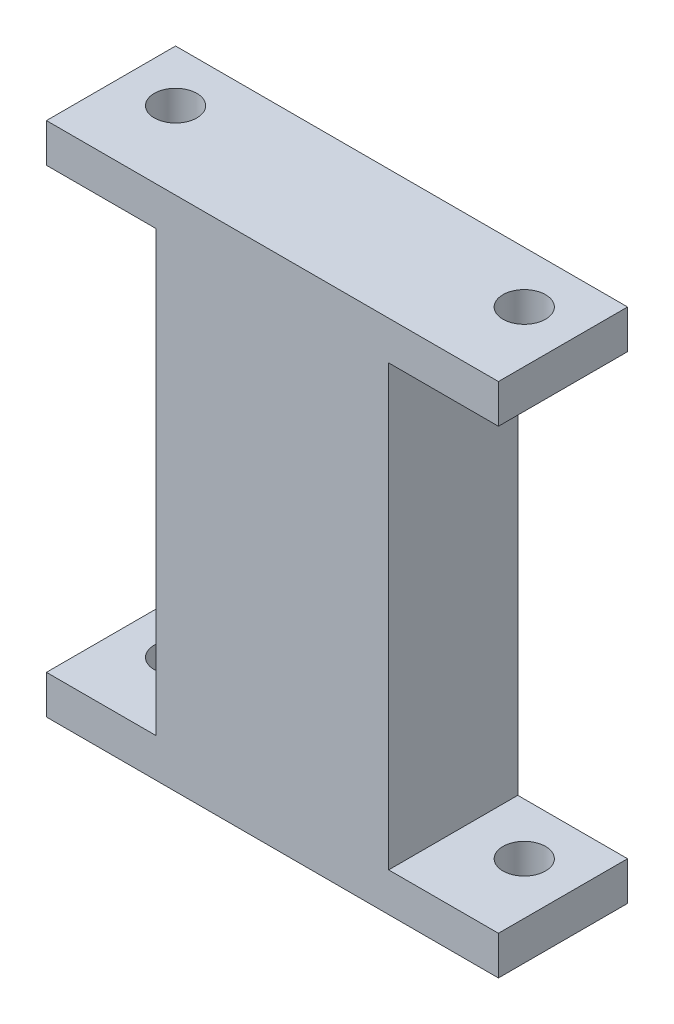
ISO-10303-21;
HEADER;
FILE_DESCRIPTION(('STEP AP214'),'2;1');
FILE_NAME('part.step','',(''),(''),'','','');
FILE_SCHEMA(('AUTOMOTIVE_DESIGN { 1 0 10303 214 1 1 1 1 }'));
ENDSEC;
DATA;
#1=APPLICATION_CONTEXT('core data for automotive mechanical design processes');
#2=APPLICATION_PROTOCOL_DEFINITION('international standard','automotive_design',2000,#1);
#3=PRODUCT_CONTEXT('',#1,'mechanical');
#4=PRODUCT('Part','Part','',(#3));
#5=PRODUCT_RELATED_PRODUCT_CATEGORY('part','',(#4));
#6=PRODUCT_DEFINITION_FORMATION('','',#4);
#7=PRODUCT_DEFINITION_CONTEXT('part definition',#1,'design');
#8=PRODUCT_DEFINITION('design','',#6,#7);
#9=PRODUCT_DEFINITION_SHAPE('','',#8);
#10=(LENGTH_UNIT() NAMED_UNIT(*) SI_UNIT(.MILLI.,.METRE.));
#11=(NAMED_UNIT(*) PLANE_ANGLE_UNIT() SI_UNIT($,.RADIAN.));
#12=(NAMED_UNIT(*) SI_UNIT($,.STERADIAN.) SOLID_ANGLE_UNIT());
#13=UNCERTAINTY_MEASURE_WITH_UNIT(LENGTH_MEASURE(1.E-05),#10,'distance_accuracy_value','');
#14=(GEOMETRIC_REPRESENTATION_CONTEXT(3) GLOBAL_UNCERTAINTY_ASSIGNED_CONTEXT((#13)) GLOBAL_UNIT_ASSIGNED_CONTEXT((#10,
#11,#12)) REPRESENTATION_CONTEXT('',''));
#15=CARTESIAN_POINT('',(0.,0.,0.));
#16=DIRECTION('',(0.,0.,1.));
#17=DIRECTION('',(1.,0.,0.));
#18=AXIS2_PLACEMENT_3D('',#15,#16,#17);
#19=CARTESIAN_POINT('',(0.,1.5,0.));
#20=DIRECTION('',(0.,-1.,0.));
#21=DIRECTION('',(0.,0.,-1.));
#22=AXIS2_PLACEMENT_3D('',#19,#20,#21);
#23=PLANE('',#22);
#24=CARTESIAN_POINT('',(-13.5,1.5,-0.999999999999997));
#25=DIRECTION('',(0.,1.,0.));
#26=DIRECTION('',(0.,0.,1.));
#27=AXIS2_PLACEMENT_3D('',#24,#25,#26);
#28=CIRCLE('',#27,1.65);
#29=CARTESIAN_POINT('',(-13.5,1.5,0.650000000000004));
#30=VERTEX_POINT('',#29);
#31=EDGE_CURVE('E196',#30,#30,#28,.T.);
#32=ORIENTED_EDGE('',*,*,#31,.F.);
#33=EDGE_LOOP('',(#32));
#34=FACE_BOUND('',#33,.T.);
#35=DIRECTION('',(0.,0.,1.));
#36=VECTOR('',#35,1.);
#37=CARTESIAN_POINT('',(-9.,1.5,-5.));
#38=LINE('',#37,#36);
#39=CARTESIAN_POINT('',(-9.,1.5,-5.));
#40=VERTEX_POINT('',#39);
#41=CARTESIAN_POINT('',(-9.,1.5,5.));
#42=VERTEX_POINT('',#41);
#43=EDGE_CURVE('E146',#40,#42,#38,.T.);
#44=ORIENTED_EDGE('',*,*,#43,.F.);
#45=DIRECTION('',(-1.,0.,0.));
#46=VECTOR('',#45,1.);
#47=CARTESIAN_POINT('',(-17.5,1.5,-5.));
#48=LINE('',#47,#46);
#49=CARTESIAN_POINT('',(-17.5,1.5,-5.));
#50=VERTEX_POINT('',#49);
#51=EDGE_CURVE('E211',#40,#50,#48,.T.);
#52=ORIENTED_EDGE('',*,*,#51,.T.);
#53=DIRECTION('',(0.,0.,1.));
#54=VECTOR('',#53,1.);
#55=CARTESIAN_POINT('',(-17.5,1.5,5.));
#56=LINE('',#55,#54);
#57=CARTESIAN_POINT('',(-17.5,1.5,5.));
#58=VERTEX_POINT('',#57);
#59=EDGE_CURVE('E215',#50,#58,#56,.T.);
#60=ORIENTED_EDGE('',*,*,#59,.T.);
#61=DIRECTION('',(1.,0.,0.));
#62=VECTOR('',#61,1.);
#63=CARTESIAN_POINT('',(-17.5,1.5,5.));
#64=LINE('',#63,#62);
#65=EDGE_CURVE('E59',#58,#42,#64,.T.);
#66=ORIENTED_EDGE('',*,*,#65,.T.);
#67=EDGE_LOOP('',(#44,#52,#60,#66));
#68=FACE_BOUND('',#67,.T.);
#69=ADVANCED_FACE('F36',(#34,#68),#23,.F.);
#70=CARTESIAN_POINT('',(13.5,1.5,-1.));
#71=DIRECTION('',(0.,1.,0.));
#72=DIRECTION('',(0.,0.,-1.));
#73=AXIS2_PLACEMENT_3D('',#70,#71,#72);
#74=CIRCLE('',#73,1.65);
#75=CARTESIAN_POINT('',(13.5,1.5,-2.65));
#76=VERTEX_POINT('',#75);
#77=EDGE_CURVE('E195',#76,#76,#74,.T.);
#78=ORIENTED_EDGE('',*,*,#77,.F.);
#79=EDGE_LOOP('',(#78));
#80=FACE_BOUND('',#79,.T.);
#81=DIRECTION('',(0.,0.,-1.));
#82=VECTOR('',#81,1.);
#83=CARTESIAN_POINT('',(9.,1.5,-5.));
#84=LINE('',#83,#82);
#85=CARTESIAN_POINT('',(8.99999999999999,1.5,5.));
#86=VERTEX_POINT('',#85);
#87=CARTESIAN_POINT('',(9.,1.5,-5.));
#88=VERTEX_POINT('',#87);
#89=EDGE_CURVE('E51',#86,#88,#84,.T.);
#90=ORIENTED_EDGE('',*,*,#89,.F.);
#91=CARTESIAN_POINT('',(17.5,1.5,5.));
#92=VERTEX_POINT('',#91);
#93=EDGE_CURVE('E217',#86,#92,#64,.T.);
#94=ORIENTED_EDGE('',*,*,#93,.T.);
#95=DIRECTION('',(0.,0.,-1.));
#96=VECTOR('',#95,1.);
#97=CARTESIAN_POINT('',(17.5,1.5,5.));
#98=LINE('',#97,#96);
#99=CARTESIAN_POINT('',(17.5,1.5,-5.));
#100=VERTEX_POINT('',#99);
#101=EDGE_CURVE('E208',#92,#100,#98,.T.);
#102=ORIENTED_EDGE('',*,*,#101,.T.);
#103=EDGE_CURVE('E213',#100,#88,#48,.T.);
#104=ORIENTED_EDGE('',*,*,#103,.T.);
#105=EDGE_LOOP('',(#90,#94,#102,#104));
#106=FACE_BOUND('',#105,.T.);
#107=ADVANCED_FACE('F248',(#80,#106),#23,.F.);
#108=CARTESIAN_POINT('',(17.5,1.5,5.));
#109=DIRECTION('',(-1.,0.,0.));
#110=DIRECTION('',(0.,0.,1.));
#111=AXIS2_PLACEMENT_3D('',#108,#109,#110);
#112=PLANE('',#111);
#113=DIRECTION('',(0.,0.,-1.));
#114=VECTOR('',#113,1.);
#115=CARTESIAN_POINT('',(17.5,-1.5,5.));
#116=LINE('',#115,#114);
#117=CARTESIAN_POINT('',(17.5,-1.5,5.));
#118=VERTEX_POINT('',#117);
#119=CARTESIAN_POINT('',(17.5,-1.5,-5.));
#120=VERTEX_POINT('',#119);
#121=EDGE_CURVE('E203',#118,#120,#116,.T.);
#122=ORIENTED_EDGE('',*,*,#121,.T.);
#123=DIRECTION('',(0.,-1.,0.));
#124=VECTOR('',#123,1.);
#125=CARTESIAN_POINT('',(17.5,1.5,-5.));
#126=LINE('',#125,#124);
#127=EDGE_CURVE('E11',#100,#120,#126,.T.);
#128=ORIENTED_EDGE('',*,*,#127,.F.);
#129=ORIENTED_EDGE('',*,*,#101,.F.);
#130=DIRECTION('',(0.,-1.,0.));
#131=VECTOR('',#130,1.);
#132=CARTESIAN_POINT('',(17.5,1.5,5.));
#133=LINE('',#132,#131);
#134=EDGE_CURVE('E219',#92,#118,#133,.T.);
#135=ORIENTED_EDGE('',*,*,#134,.T.);
#136=EDGE_LOOP('',(#122,#128,#129,#135));
#137=FACE_BOUND('',#136,.T.);
#138=ADVANCED_FACE('F38',(#137),#112,.F.);
#139=CARTESIAN_POINT('',(-17.5,1.5,-5.));
#140=DIRECTION('',(0.,0.,1.));
#141=DIRECTION('',(1.,0.,0.));
#142=AXIS2_PLACEMENT_3D('',#139,#140,#141);
#143=PLANE('',#142);
#144=DIRECTION('',(-1.,0.,0.));
#145=VECTOR('',#144,1.);
#146=CARTESIAN_POINT('',(-17.5,-1.5,-5.));
#147=LINE('',#146,#145);
#148=CARTESIAN_POINT('',(-17.5,-1.5,-5.));
#149=VERTEX_POINT('',#148);
#150=EDGE_CURVE('E222',#120,#149,#147,.T.);
#151=ORIENTED_EDGE('',*,*,#150,.T.);
#152=DIRECTION('',(0.,-1.,0.));
#153=VECTOR('',#152,1.);
#154=CARTESIAN_POINT('',(-17.5,1.5,-5.));
#155=LINE('',#154,#153);
#156=EDGE_CURVE('E44',#50,#149,#155,.T.);
#157=ORIENTED_EDGE('',*,*,#156,.F.);
#158=ORIENTED_EDGE('',*,*,#51,.F.);
#159=DIRECTION('',(0.,-1.,0.));
#160=VECTOR('',#159,1.);
#161=CARTESIAN_POINT('',(-9.,35.5,-5.));
#162=LINE('',#161,#160);
#163=CARTESIAN_POINT('',(-9.,35.5,-5.));
#164=VERTEX_POINT('',#163);
#165=EDGE_CURVE('E183',#164,#40,#162,.T.);
#166=ORIENTED_EDGE('',*,*,#165,.F.);
#167=DIRECTION('',(-1.,0.,0.));
#168=VECTOR('',#167,1.);
#169=CARTESIAN_POINT('',(-17.5,35.5,-5.));
#170=LINE('',#169,#168);
#171=CARTESIAN_POINT('',(-17.5,35.5,-5.));
#172=VERTEX_POINT('',#171);
#173=EDGE_CURVE('E165',#164,#172,#170,.T.);
#174=ORIENTED_EDGE('',*,*,#173,.T.);
#175=DIRECTION('',(0.,1.,0.));
#176=VECTOR('',#175,1.);
#177=CARTESIAN_POINT('',(-17.5,35.5,-5.));
#178=LINE('',#177,#176);
#179=CARTESIAN_POINT('',(-17.5,38.5,-5.));
#180=VERTEX_POINT('',#179);
#181=EDGE_CURVE('E175',#172,#180,#178,.T.);
#182=ORIENTED_EDGE('',*,*,#181,.T.);
#183=DIRECTION('',(-1.,0.,0.));
#184=VECTOR('',#183,1.);
#185=CARTESIAN_POINT('',(-17.5,38.5,-5.));
#186=LINE('',#185,#184);
#187=CARTESIAN_POINT('',(17.5,38.5,-5.));
#188=VERTEX_POINT('',#187);
#189=EDGE_CURVE('E152',#188,#180,#186,.T.);
#190=ORIENTED_EDGE('',*,*,#189,.F.);
#191=DIRECTION('',(0.,1.,0.));
#192=VECTOR('',#191,1.);
#193=CARTESIAN_POINT('',(17.5,35.5,-5.));
#194=LINE('',#193,#192);
#195=CARTESIAN_POINT('',(17.5,35.5,-5.));
#196=VERTEX_POINT('',#195);
#197=EDGE_CURVE('E167',#196,#188,#194,.T.);
#198=ORIENTED_EDGE('',*,*,#197,.F.);
#199=CARTESIAN_POINT('',(8.99999999999999,35.5,-5.));
#200=VERTEX_POINT('',#199);
#201=EDGE_CURVE('E151',#196,#200,#170,.T.);
#202=ORIENTED_EDGE('',*,*,#201,.T.);
#203=DIRECTION('',(0.,-1.,0.));
#204=VECTOR('',#203,1.);
#205=CARTESIAN_POINT('',(9.,35.5,-5.));
#206=LINE('',#205,#204);
#207=EDGE_CURVE('E189',#200,#88,#206,.T.);
#208=ORIENTED_EDGE('',*,*,#207,.T.);
#209=ORIENTED_EDGE('',*,*,#103,.F.);
#210=ORIENTED_EDGE('',*,*,#127,.T.);
#211=EDGE_LOOP('',(#151,#157,#158,#166,#174,#182,#190,#198,#202,#208,#209,#210));
#212=FACE_BOUND('',#211,.T.);
#213=ADVANCED_FACE('F251',(#212),#143,.F.);
#214=CARTESIAN_POINT('',(-17.5,1.5,5.));
#215=DIRECTION('',(1.,0.,0.));
#216=DIRECTION('',(0.,0.,-1.));
#217=AXIS2_PLACEMENT_3D('',#214,#215,#216);
#218=PLANE('',#217);
#219=DIRECTION('',(0.,0.,1.));
#220=VECTOR('',#219,1.);
#221=CARTESIAN_POINT('',(-17.5,-1.5,5.));
#222=LINE('',#221,#220);
#223=CARTESIAN_POINT('',(-17.5,-1.5,5.));
#224=VERTEX_POINT('',#223);
#225=EDGE_CURVE('E224',#149,#224,#222,.T.);
#226=ORIENTED_EDGE('',*,*,#225,.T.);
#227=DIRECTION('',(0.,-1.,0.));
#228=VECTOR('',#227,1.);
#229=CARTESIAN_POINT('',(-17.5,1.5,5.));
#230=LINE('',#229,#228);
#231=EDGE_CURVE('E229',#58,#224,#230,.T.);
#232=ORIENTED_EDGE('',*,*,#231,.F.);
#233=ORIENTED_EDGE('',*,*,#59,.F.);
#234=ORIENTED_EDGE('',*,*,#156,.T.);
#235=EDGE_LOOP('',(#226,#232,#233,#234));
#236=FACE_BOUND('',#235,.T.);
#237=ADVANCED_FACE('F236',(#236),#218,.F.);
#238=CARTESIAN_POINT('',(-17.5,1.5,5.));
#239=DIRECTION('',(0.,0.,-1.));
#240=DIRECTION('',(-1.,0.,0.));
#241=AXIS2_PLACEMENT_3D('',#238,#239,#240);
#242=PLANE('',#241);
#243=DIRECTION('',(1.,0.,0.));
#244=VECTOR('',#243,1.);
#245=CARTESIAN_POINT('',(-17.5,-1.5,5.));
#246=LINE('',#245,#244);
#247=EDGE_CURVE('E212',#224,#118,#246,.T.);
#248=ORIENTED_EDGE('',*,*,#247,.T.);
#249=ORIENTED_EDGE('',*,*,#134,.F.);
#250=ORIENTED_EDGE('',*,*,#93,.F.);
#251=DIRECTION('',(0.,-1.,0.));
#252=VECTOR('',#251,1.);
#253=CARTESIAN_POINT('',(9.,35.5,5.));
#254=LINE('',#253,#252);
#255=CARTESIAN_POINT('',(9.,35.5,5.));
#256=VERTEX_POINT('',#255);
#257=EDGE_CURVE('E131',#256,#86,#254,.T.);
#258=ORIENTED_EDGE('',*,*,#257,.F.);
#259=DIRECTION('',(1.,0.,0.));
#260=VECTOR('',#259,1.);
#261=CARTESIAN_POINT('',(-17.5,35.5,5.));
#262=LINE('',#261,#260);
#263=CARTESIAN_POINT('',(17.5,35.5,5.));
#264=VERTEX_POINT('',#263);
#265=EDGE_CURVE('E124',#256,#264,#262,.T.);
#266=ORIENTED_EDGE('',*,*,#265,.T.);
#267=DIRECTION('',(0.,1.,0.));
#268=VECTOR('',#267,1.);
#269=CARTESIAN_POINT('',(17.5,35.5,5.));
#270=LINE('',#269,#268);
#271=CARTESIAN_POINT('',(17.5,38.5,5.));
#272=VERTEX_POINT('',#271);
#273=EDGE_CURVE('E128',#264,#272,#270,.T.);
#274=ORIENTED_EDGE('',*,*,#273,.T.);
#275=DIRECTION('',(1.,0.,0.));
#276=VECTOR('',#275,1.);
#277=CARTESIAN_POINT('',(-17.5,38.5,5.));
#278=LINE('',#277,#276);
#279=CARTESIAN_POINT('',(-17.5,38.5,5.));
#280=VERTEX_POINT('',#279);
#281=EDGE_CURVE('E169',#280,#272,#278,.T.);
#282=ORIENTED_EDGE('',*,*,#281,.F.);
#283=DIRECTION('',(0.,1.,0.));
#284=VECTOR('',#283,1.);
#285=CARTESIAN_POINT('',(-17.5,35.5,5.));
#286=LINE('',#285,#284);
#287=CARTESIAN_POINT('',(-17.5,35.5,5.));
#288=VERTEX_POINT('',#287);
#289=EDGE_CURVE('E147',#288,#280,#286,.T.);
#290=ORIENTED_EDGE('',*,*,#289,.F.);
#291=CARTESIAN_POINT('',(-9.,35.5,5.));
#292=VERTEX_POINT('',#291);
#293=EDGE_CURVE('E136',#288,#292,#262,.T.);
#294=ORIENTED_EDGE('',*,*,#293,.T.);
#295=DIRECTION('',(0.,-1.,0.));
#296=VECTOR('',#295,1.);
#297=CARTESIAN_POINT('',(-9.,35.5,5.));
#298=LINE('',#297,#296);
#299=EDGE_CURVE('E193',#292,#42,#298,.T.);
#300=ORIENTED_EDGE('',*,*,#299,.T.);
#301=ORIENTED_EDGE('',*,*,#65,.F.);
#302=ORIENTED_EDGE('',*,*,#231,.T.);
#303=EDGE_LOOP('',(#248,#249,#250,#258,#266,#274,#282,#290,#294,#300,#301,#302));
#304=FACE_BOUND('',#303,.T.);
#305=ADVANCED_FACE('F126',(#304),#242,.F.);
#306=CARTESIAN_POINT('',(0.,-1.5,0.));
#307=DIRECTION('',(0.,-1.,0.));
#308=DIRECTION('',(0.,0.,-1.));
#309=AXIS2_PLACEMENT_3D('',#306,#307,#308);
#310=PLANE('',#309);
#311=CARTESIAN_POINT('',(-13.5,-1.5,-0.999999999999997));
#312=DIRECTION('',(0.,-1.,0.));
#313=DIRECTION('',(0.,0.,-1.));
#314=AXIS2_PLACEMENT_3D('',#311,#312,#313);
#315=CIRCLE('',#314,1.65);
#316=CARTESIAN_POINT('',(-13.5,-1.5,-2.65));
#317=VERTEX_POINT('',#316);
#318=EDGE_CURVE('E199',#317,#317,#315,.F.);
#319=ORIENTED_EDGE('',*,*,#318,.T.);
#320=EDGE_LOOP('',(#319));
#321=FACE_BOUND('',#320,.T.);
#322=CARTESIAN_POINT('',(13.5,-1.5,-1.));
#323=DIRECTION('',(0.,-1.,0.));
#324=DIRECTION('',(0.,0.,-1.));
#325=AXIS2_PLACEMENT_3D('',#322,#323,#324);
#326=CIRCLE('',#325,1.65);
#327=CARTESIAN_POINT('',(13.5,-1.5,-2.65));
#328=VERTEX_POINT('',#327);
#329=EDGE_CURVE('E200',#328,#328,#326,.F.);
#330=ORIENTED_EDGE('',*,*,#329,.T.);
#331=EDGE_LOOP('',(#330));
#332=FACE_BOUND('',#331,.T.);
#333=ORIENTED_EDGE('',*,*,#121,.F.);
#334=ORIENTED_EDGE('',*,*,#247,.F.);
#335=ORIENTED_EDGE('',*,*,#225,.F.);
#336=ORIENTED_EDGE('',*,*,#150,.F.);
#337=EDGE_LOOP('',(#333,#334,#335,#336));
#338=FACE_BOUND('',#337,.T.);
#339=ADVANCED_FACE('F243',(#321,#332,#338),#310,.T.);
#340=CARTESIAN_POINT('',(13.5,-6.16690475583122,-1.));
#341=DIRECTION('',(0.,1.,0.));
#342=DIRECTION('',(0.,0.,1.));
#343=AXIS2_PLACEMENT_3D('',#340,#341,#342);
#344=CYLINDRICAL_SURFACE('',#343,1.65);
#345=ORIENTED_EDGE('',*,*,#77,.T.);
#346=EDGE_LOOP('',(#345));
#347=FACE_BOUND('',#346,.T.);
#348=ORIENTED_EDGE('',*,*,#329,.F.);
#349=EDGE_LOOP('',(#348));
#350=FACE_BOUND('',#349,.T.);
#351=ADVANCED_FACE('F277',(#347,#350),#344,.F.);
#352=CARTESIAN_POINT('',(-13.5,-6.16690475583122,-0.999999999999997));
#353=DIRECTION('',(0.,1.,0.));
#354=DIRECTION('',(0.,0.,1.));
#355=AXIS2_PLACEMENT_3D('',#352,#353,#354);
#356=CYLINDRICAL_SURFACE('',#355,1.65);
#357=ORIENTED_EDGE('',*,*,#31,.T.);
#358=EDGE_LOOP('',(#357));
#359=FACE_BOUND('',#358,.T.);
#360=ORIENTED_EDGE('',*,*,#318,.F.);
#361=EDGE_LOOP('',(#360));
#362=FACE_BOUND('',#361,.T.);
#363=ADVANCED_FACE('F323',(#359,#362),#356,.F.);
#364=CARTESIAN_POINT('',(-9.,35.5,-5.));
#365=DIRECTION('',(1.,0.,0.));
#366=DIRECTION('',(0.,0.,-1.));
#367=AXIS2_PLACEMENT_3D('',#364,#365,#366);
#368=PLANE('',#367);
#369=ORIENTED_EDGE('',*,*,#43,.T.);
#370=ORIENTED_EDGE('',*,*,#299,.F.);
#371=DIRECTION('',(0.,0.,1.));
#372=VECTOR('',#371,1.);
#373=CARTESIAN_POINT('',(-9.,35.5,-5.));
#374=LINE('',#373,#372);
#375=EDGE_CURVE('E178',#164,#292,#374,.T.);
#376=ORIENTED_EDGE('',*,*,#375,.F.);
#377=ORIENTED_EDGE('',*,*,#165,.T.);
#378=EDGE_LOOP('',(#369,#370,#376,#377));
#379=FACE_BOUND('',#378,.T.);
#380=ADVANCED_FACE('F266',(#379),#368,.F.);
#381=CARTESIAN_POINT('',(9.,35.5,-5.));
#382=DIRECTION('',(-1.,0.,0.));
#383=DIRECTION('',(0.,0.,1.));
#384=AXIS2_PLACEMENT_3D('',#381,#382,#383);
#385=PLANE('',#384);
#386=ORIENTED_EDGE('',*,*,#89,.T.);
#387=ORIENTED_EDGE('',*,*,#207,.F.);
#388=DIRECTION('',(0.,0.,-1.));
#389=VECTOR('',#388,1.);
#390=CARTESIAN_POINT('',(9.,35.5,-5.));
#391=LINE('',#390,#389);
#392=EDGE_CURVE('E181',#256,#200,#391,.T.);
#393=ORIENTED_EDGE('',*,*,#392,.F.);
#394=ORIENTED_EDGE('',*,*,#257,.T.);
#395=EDGE_LOOP('',(#386,#387,#393,#394));
#396=FACE_BOUND('',#395,.T.);
#397=ADVANCED_FACE('F250',(#396),#385,.F.);
#398=CARTESIAN_POINT('',(0.,35.5,0.));
#399=DIRECTION('',(0.,1.,0.));
#400=DIRECTION('',(0.,0.,-1.));
#401=AXIS2_PLACEMENT_3D('',#398,#399,#400);
#402=PLANE('',#401);
#403=CARTESIAN_POINT('',(-13.5,35.5,-0.999999999999997));
#404=DIRECTION('',(0.,1.,0.));
#405=DIRECTION('',(0.,0.,1.));
#406=AXIS2_PLACEMENT_3D('',#403,#404,#405);
#407=CIRCLE('',#406,1.65);
#408=CARTESIAN_POINT('',(-13.5,35.5,0.650000000000004));
#409=VERTEX_POINT('',#408);
#410=EDGE_CURVE('E443',#409,#409,#407,.T.);
#411=ORIENTED_EDGE('',*,*,#410,.T.);
#412=EDGE_LOOP('',(#411));
#413=FACE_BOUND('',#412,.T.);
#414=ORIENTED_EDGE('',*,*,#173,.F.);
#415=ORIENTED_EDGE('',*,*,#375,.T.);
#416=ORIENTED_EDGE('',*,*,#293,.F.);
#417=DIRECTION('',(0.,0.,1.));
#418=VECTOR('',#417,1.);
#419=CARTESIAN_POINT('',(-17.5,35.5,5.));
#420=LINE('',#419,#418);
#421=EDGE_CURVE('E162',#172,#288,#420,.T.);
#422=ORIENTED_EDGE('',*,*,#421,.F.);
#423=EDGE_LOOP('',(#414,#415,#416,#422));
#424=FACE_BOUND('',#423,.T.);
#425=ADVANCED_FACE('F261',(#413,#424),#402,.F.);
#426=CARTESIAN_POINT('',(13.5,35.5,-1.));
#427=DIRECTION('',(0.,1.,0.));
#428=DIRECTION('',(0.,0.,-1.));
#429=AXIS2_PLACEMENT_3D('',#426,#427,#428);
#430=CIRCLE('',#429,1.65);
#431=CARTESIAN_POINT('',(13.5,35.5,-2.65));
#432=VERTEX_POINT('',#431);
#433=EDGE_CURVE('E448',#432,#432,#430,.T.);
#434=ORIENTED_EDGE('',*,*,#433,.T.);
#435=EDGE_LOOP('',(#434));
#436=FACE_BOUND('',#435,.T.);
#437=ORIENTED_EDGE('',*,*,#265,.F.);
#438=ORIENTED_EDGE('',*,*,#392,.T.);
#439=ORIENTED_EDGE('',*,*,#201,.F.);
#440=DIRECTION('',(0.,0.,-1.));
#441=VECTOR('',#440,1.);
#442=CARTESIAN_POINT('',(17.5,35.5,5.));
#443=LINE('',#442,#441);
#444=EDGE_CURVE('E137',#264,#196,#443,.T.);
#445=ORIENTED_EDGE('',*,*,#444,.F.);
#446=EDGE_LOOP('',(#437,#438,#439,#445));
#447=FACE_BOUND('',#446,.T.);
#448=ADVANCED_FACE('F149',(#436,#447),#402,.F.);
#449=CARTESIAN_POINT('',(17.5,35.5,5.));
#450=DIRECTION('',(1.,0.,0.));
#451=DIRECTION('',(0.,0.,-1.));
#452=AXIS2_PLACEMENT_3D('',#449,#450,#451);
#453=PLANE('',#452);
#454=DIRECTION('',(0.,0.,-1.));
#455=VECTOR('',#454,1.);
#456=CARTESIAN_POINT('',(17.5,38.5,5.));
#457=LINE('',#456,#455);
#458=EDGE_CURVE('E144',#272,#188,#457,.T.);
#459=ORIENTED_EDGE('',*,*,#458,.F.);
#460=ORIENTED_EDGE('',*,*,#273,.F.);
#461=ORIENTED_EDGE('',*,*,#444,.T.);
#462=ORIENTED_EDGE('',*,*,#197,.T.);
#463=EDGE_LOOP('',(#459,#460,#461,#462));
#464=FACE_BOUND('',#463,.T.);
#465=ADVANCED_FACE('F141',(#464),#453,.T.);
#466=CARTESIAN_POINT('',(-17.5,35.5,5.));
#467=DIRECTION('',(-1.,0.,0.));
#468=DIRECTION('',(0.,0.,1.));
#469=AXIS2_PLACEMENT_3D('',#466,#467,#468);
#470=PLANE('',#469);
#471=DIRECTION('',(0.,0.,1.));
#472=VECTOR('',#471,1.);
#473=CARTESIAN_POINT('',(-17.5,38.5,5.));
#474=LINE('',#473,#472);
#475=EDGE_CURVE('E155',#180,#280,#474,.T.);
#476=ORIENTED_EDGE('',*,*,#475,.F.);
#477=ORIENTED_EDGE('',*,*,#181,.F.);
#478=ORIENTED_EDGE('',*,*,#421,.T.);
#479=ORIENTED_EDGE('',*,*,#289,.T.);
#480=EDGE_LOOP('',(#476,#477,#478,#479));
#481=FACE_BOUND('',#480,.T.);
#482=ADVANCED_FACE('F264',(#481),#470,.T.);
#483=CARTESIAN_POINT('',(0.,38.5,0.));
#484=DIRECTION('',(0.,1.,0.));
#485=DIRECTION('',(0.,0.,-1.));
#486=AXIS2_PLACEMENT_3D('',#483,#484,#485);
#487=PLANE('',#486);
#488=CARTESIAN_POINT('',(-13.5,38.5,-0.999999999999997));
#489=DIRECTION('',(0.,1.,0.));
#490=DIRECTION('',(0.,0.,1.));
#491=AXIS2_PLACEMENT_3D('',#488,#489,#490);
#492=CIRCLE('',#491,1.65);
#493=CARTESIAN_POINT('',(-13.5,38.5,0.650000000000004));
#494=VERTEX_POINT('',#493);
#495=EDGE_CURVE('E170',#494,#494,#492,.T.);
#496=ORIENTED_EDGE('',*,*,#495,.F.);
#497=EDGE_LOOP('',(#496));
#498=FACE_BOUND('',#497,.T.);
#499=CARTESIAN_POINT('',(13.5,38.5,-1.));
#500=DIRECTION('',(0.,1.,0.));
#501=DIRECTION('',(0.,0.,1.));
#502=AXIS2_PLACEMENT_3D('',#499,#500,#501);
#503=CIRCLE('',#502,1.65);
#504=CARTESIAN_POINT('',(13.5,38.5,0.650000000000003));
#505=VERTEX_POINT('',#504);
#506=EDGE_CURVE('E158',#505,#505,#503,.T.);
#507=ORIENTED_EDGE('',*,*,#506,.F.);
#508=EDGE_LOOP('',(#507));
#509=FACE_BOUND('',#508,.T.);
#510=ORIENTED_EDGE('',*,*,#458,.T.);
#511=ORIENTED_EDGE('',*,*,#189,.T.);
#512=ORIENTED_EDGE('',*,*,#475,.T.);
#513=ORIENTED_EDGE('',*,*,#281,.T.);
#514=EDGE_LOOP('',(#510,#511,#512,#513));
#515=FACE_BOUND('',#514,.T.);
#516=ADVANCED_FACE('F254',(#498,#509,#515),#487,.T.);
#517=CARTESIAN_POINT('',(13.5,77.1669047558312,-1.));
#518=DIRECTION('',(0.,-1.,0.));
#519=DIRECTION('',(0.,0.,-1.));
#520=AXIS2_PLACEMENT_3D('',#517,#518,#519);
#521=CYLINDRICAL_SURFACE('',#520,1.65);
#522=ORIENTED_EDGE('',*,*,#433,.F.);
#523=EDGE_LOOP('',(#522));
#524=FACE_BOUND('',#523,.T.);
#525=ORIENTED_EDGE('',*,*,#506,.T.);
#526=EDGE_LOOP('',(#525));
#527=FACE_BOUND('',#526,.T.);
#528=ADVANCED_FACE('F372',(#524,#527),#521,.F.);
#529=CARTESIAN_POINT('',(-13.5,77.1669047558312,-0.999999999999997));
#530=DIRECTION('',(0.,-1.,0.));
#531=DIRECTION('',(0.,0.,-1.));
#532=AXIS2_PLACEMENT_3D('',#529,#530,#531);
#533=CYLINDRICAL_SURFACE('',#532,1.65);
#534=ORIENTED_EDGE('',*,*,#410,.F.);
#535=EDGE_LOOP('',(#534));
#536=FACE_BOUND('',#535,.T.);
#537=ORIENTED_EDGE('',*,*,#495,.T.);
#538=EDGE_LOOP('',(#537));
#539=FACE_BOUND('',#538,.T.);
#540=ADVANCED_FACE('F382',(#536,#539),#533,.F.);
#541=CLOSED_SHELL('',(#69,#107,#138,#213,#237,#305,#339,#351,#363,#380,#397,#425,#448,#465,#482,
#516,#528,#540));
#542=MANIFOLD_SOLID_BREP('B2',#541);
#543=ADVANCED_BREP_SHAPE_REPRESENTATION('',(#18,#542),#14);
#544=SHAPE_DEFINITION_REPRESENTATION(#9,#543);
ENDSEC;
END-ISO-10303-21;
